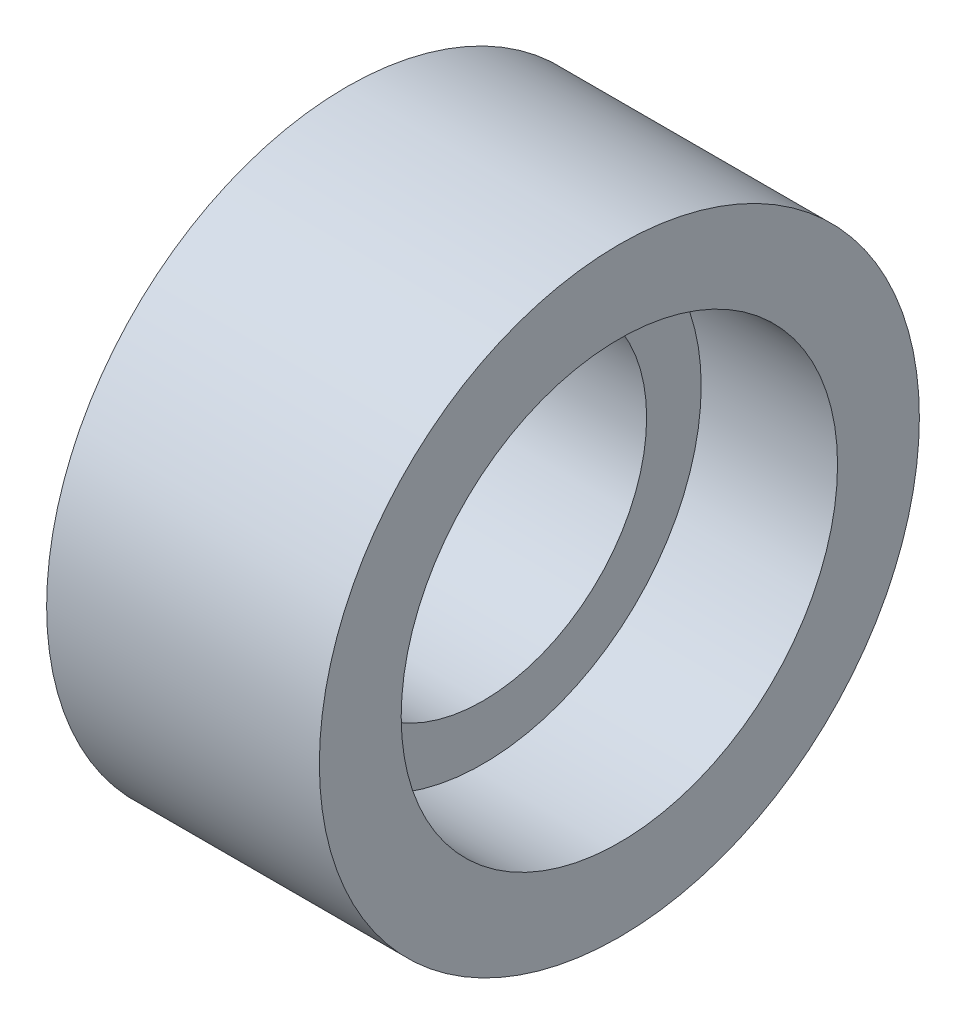
ISO-10303-21;
HEADER;
FILE_DESCRIPTION(('STEP AP214'),'2;1');
FILE_NAME('part.step','',(''),(''),'','','');
FILE_SCHEMA(('AUTOMOTIVE_DESIGN { 1 0 10303 214 1 1 1 1 }'));
ENDSEC;
DATA;
#1=APPLICATION_CONTEXT('core data for automotive mechanical design processes');
#2=APPLICATION_PROTOCOL_DEFINITION('international standard','automotive_design',2000,#1);
#3=PRODUCT_CONTEXT('',#1,'mechanical');
#4=PRODUCT('Part','Part','',(#3));
#5=PRODUCT_RELATED_PRODUCT_CATEGORY('part','',(#4));
#6=PRODUCT_DEFINITION_FORMATION('','',#4);
#7=PRODUCT_DEFINITION_CONTEXT('part definition',#1,'design');
#8=PRODUCT_DEFINITION('design','',#6,#7);
#9=PRODUCT_DEFINITION_SHAPE('','',#8);
#10=(LENGTH_UNIT() NAMED_UNIT(*) SI_UNIT(.MILLI.,.METRE.));
#11=(NAMED_UNIT(*) PLANE_ANGLE_UNIT() SI_UNIT($,.RADIAN.));
#12=(NAMED_UNIT(*) SI_UNIT($,.STERADIAN.) SOLID_ANGLE_UNIT());
#13=UNCERTAINTY_MEASURE_WITH_UNIT(LENGTH_MEASURE(1.E-05),#10,'distance_accuracy_value','');
#14=(GEOMETRIC_REPRESENTATION_CONTEXT(3) GLOBAL_UNCERTAINTY_ASSIGNED_CONTEXT((#13)) GLOBAL_UNIT_ASSIGNED_CONTEXT((#10,
#11,#12)) REPRESENTATION_CONTEXT('',''));
#15=CARTESIAN_POINT('',(0.,0.,0.));
#16=DIRECTION('',(0.,0.,1.));
#17=DIRECTION('',(1.,0.,0.));
#18=AXIS2_PLACEMENT_3D('',#15,#16,#17);
#19=CARTESIAN_POINT('',(0.,0.,0.));
#20=DIRECTION('',(-1.,0.,0.));
#21=DIRECTION('',(0.,0.,1.));
#22=AXIS2_PLACEMENT_3D('',#19,#20,#21);
#23=CYLINDRICAL_SURFACE('',#22,11.);
#24=CARTESIAN_POINT('',(10.9259367034834,0.,0.));
#25=DIRECTION('',(-1.,0.,0.));
#26=DIRECTION('',(0.,0.,1.));
#27=AXIS2_PLACEMENT_3D('',#24,#25,#26);
#28=CIRCLE('',#27,11.);
#29=CARTESIAN_POINT('',(10.9259367034834,0.,11.));
#30=VERTEX_POINT('',#29);
#31=EDGE_CURVE('E51',#30,#30,#28,.T.);
#32=ORIENTED_EDGE('',*,*,#31,.F.);
#33=EDGE_LOOP('',(#32));
#34=FACE_BOUND('',#33,.T.);
#35=CARTESIAN_POINT('',(20.9259367034834,0.,0.));
#36=DIRECTION('',(-1.,0.,0.));
#37=DIRECTION('',(0.,0.,1.));
#38=AXIS2_PLACEMENT_3D('',#35,#36,#37);
#39=CIRCLE('',#38,11.);
#40=CARTESIAN_POINT('',(20.9259367034834,0.,11.));
#41=VERTEX_POINT('',#40);
#42=EDGE_CURVE('E10',#41,#41,#39,.T.);
#43=ORIENTED_EDGE('',*,*,#42,.T.);
#44=EDGE_LOOP('',(#43));
#45=FACE_BOUND('',#44,.T.);
#46=ADVANCED_FACE('F29',(#34,#45),#23,.T.);
#47=CARTESIAN_POINT('',(20.9259367034834,11.,0.));
#48=DIRECTION('',(-1.,0.,0.));
#49=DIRECTION('',(0.,0.,1.));
#50=AXIS2_PLACEMENT_3D('',#47,#48,#49);
#51=PLANE('',#50);
#52=ORIENTED_EDGE('',*,*,#42,.F.);
#53=EDGE_LOOP('',(#52));
#54=FACE_BOUND('',#53,.T.);
#55=CARTESIAN_POINT('',(20.9259367034834,0.,0.));
#56=DIRECTION('',(-1.,0.,0.));
#57=DIRECTION('',(0.,0.,1.));
#58=AXIS2_PLACEMENT_3D('',#55,#56,#57);
#59=CIRCLE('',#58,8.);
#60=CARTESIAN_POINT('',(20.9259367034834,0.,8.));
#61=VERTEX_POINT('',#60);
#62=EDGE_CURVE('E35',#61,#61,#59,.T.);
#63=ORIENTED_EDGE('',*,*,#62,.T.);
#64=EDGE_LOOP('',(#63));
#65=FACE_BOUND('',#64,.T.);
#66=ADVANCED_FACE('F58',(#54,#65),#51,.F.);
#67=CARTESIAN_POINT('',(0.,0.,0.));
#68=DIRECTION('',(-1.,0.,0.));
#69=DIRECTION('',(0.,0.,1.));
#70=AXIS2_PLACEMENT_3D('',#67,#68,#69);
#71=CYLINDRICAL_SURFACE('',#70,8.);
#72=ORIENTED_EDGE('',*,*,#62,.F.);
#73=EDGE_LOOP('',(#72));
#74=FACE_BOUND('',#73,.T.);
#75=CARTESIAN_POINT('',(15.9259367034834,0.,0.));
#76=DIRECTION('',(-1.,0.,0.));
#77=DIRECTION('',(0.,0.,1.));
#78=AXIS2_PLACEMENT_3D('',#75,#76,#77);
#79=CIRCLE('',#78,8.);
#80=CARTESIAN_POINT('',(15.9259367034834,0.,8.));
#81=VERTEX_POINT('',#80);
#82=EDGE_CURVE('E39',#81,#81,#79,.T.);
#83=ORIENTED_EDGE('',*,*,#82,.T.);
#84=EDGE_LOOP('',(#83));
#85=FACE_BOUND('',#84,.T.);
#86=ADVANCED_FACE('F62',(#74,#85),#71,.F.);
#87=CARTESIAN_POINT('',(15.9259367034834,8.,0.));
#88=DIRECTION('',(-1.,0.,0.));
#89=DIRECTION('',(0.,0.,1.));
#90=AXIS2_PLACEMENT_3D('',#87,#88,#89);
#91=PLANE('',#90);
#92=ORIENTED_EDGE('',*,*,#82,.F.);
#93=EDGE_LOOP('',(#92));
#94=FACE_BOUND('',#93,.T.);
#95=CARTESIAN_POINT('',(15.9259367034834,0.,0.));
#96=DIRECTION('',(-1.,0.,0.));
#97=DIRECTION('',(0.,0.,1.));
#98=AXIS2_PLACEMENT_3D('',#95,#96,#97);
#99=CIRCLE('',#98,6.);
#100=CARTESIAN_POINT('',(15.9259367034834,0.,6.));
#101=VERTEX_POINT('',#100);
#102=EDGE_CURVE('E43',#101,#101,#99,.T.);
#103=ORIENTED_EDGE('',*,*,#102,.T.);
#104=EDGE_LOOP('',(#103));
#105=FACE_BOUND('',#104,.T.);
#106=ADVANCED_FACE('F67',(#94,#105),#91,.F.);
#107=CARTESIAN_POINT('',(0.,0.,0.));
#108=DIRECTION('',(-1.,0.,0.));
#109=DIRECTION('',(0.,0.,1.));
#110=AXIS2_PLACEMENT_3D('',#107,#108,#109);
#111=CYLINDRICAL_SURFACE('',#110,6.);
#112=ORIENTED_EDGE('',*,*,#102,.F.);
#113=EDGE_LOOP('',(#112));
#114=FACE_BOUND('',#113,.T.);
#115=CARTESIAN_POINT('',(10.9259367034834,0.,0.));
#116=DIRECTION('',(-1.,0.,0.));
#117=DIRECTION('',(0.,0.,1.));
#118=AXIS2_PLACEMENT_3D('',#115,#116,#117);
#119=CIRCLE('',#118,6.);
#120=CARTESIAN_POINT('',(10.9259367034834,0.,6.));
#121=VERTEX_POINT('',#120);
#122=EDGE_CURVE('E48',#121,#121,#119,.T.);
#123=ORIENTED_EDGE('',*,*,#122,.T.);
#124=EDGE_LOOP('',(#123));
#125=FACE_BOUND('',#124,.T.);
#126=ADVANCED_FACE('F73',(#114,#125),#111,.F.);
#127=CARTESIAN_POINT('',(10.9259367034834,6.,0.));
#128=DIRECTION('',(1.,0.,0.));
#129=DIRECTION('',(0.,0.,-1.));
#130=AXIS2_PLACEMENT_3D('',#127,#128,#129);
#131=PLANE('',#130);
#132=ORIENTED_EDGE('',*,*,#122,.F.);
#133=EDGE_LOOP('',(#132));
#134=FACE_BOUND('',#133,.T.);
#135=ORIENTED_EDGE('',*,*,#31,.T.);
#136=EDGE_LOOP('',(#135));
#137=FACE_BOUND('',#136,.T.);
#138=ADVANCED_FACE('F55',(#134,#137),#131,.F.);
#139=CLOSED_SHELL('',(#46,#66,#86,#106,#126,#138));
#140=MANIFOLD_SOLID_BREP('B2',#139);
#141=ADVANCED_BREP_SHAPE_REPRESENTATION('',(#18,#140),#14);
#142=SHAPE_DEFINITION_REPRESENTATION(#9,#141);
ENDSEC;
END-ISO-10303-21;
